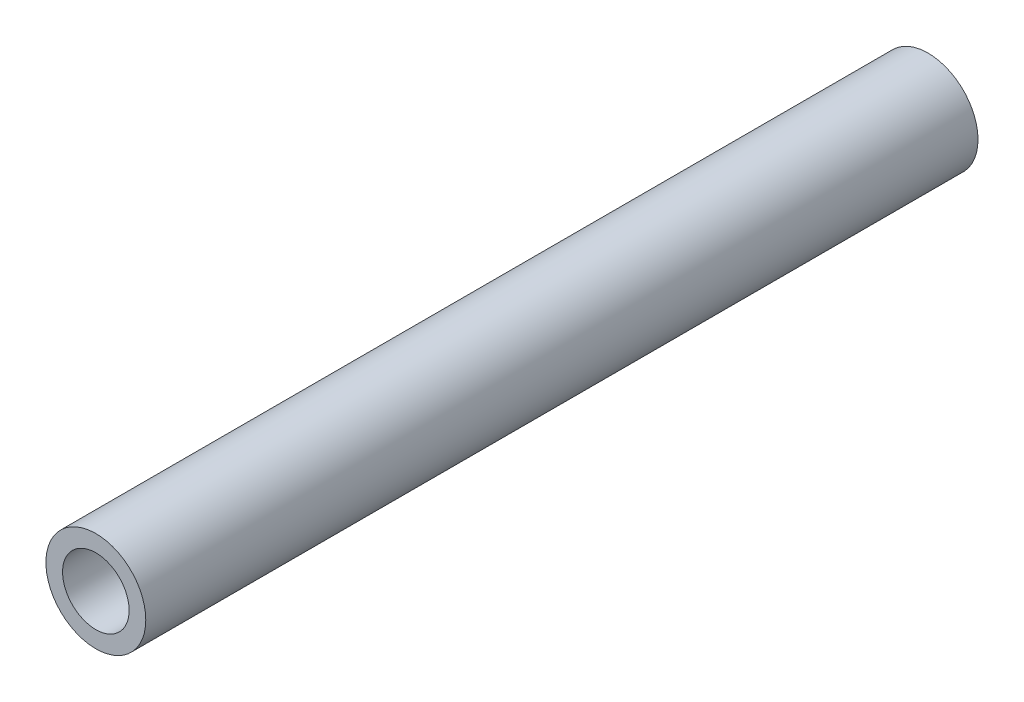
ISO-10303-21;
HEADER;
FILE_DESCRIPTION(('STEP AP214'),'2;1');
FILE_NAME('part.step','',(''),(''),'','','');
FILE_SCHEMA(('AUTOMOTIVE_DESIGN { 1 0 10303 214 1 1 1 1 }'));
ENDSEC;
DATA;
#1=APPLICATION_CONTEXT('core data for automotive mechanical design processes');
#2=APPLICATION_PROTOCOL_DEFINITION('international standard','automotive_design',2000,#1);
#3=PRODUCT_CONTEXT('',#1,'mechanical');
#4=PRODUCT('Part','Part','',(#3));
#5=PRODUCT_RELATED_PRODUCT_CATEGORY('part','',(#4));
#6=PRODUCT_DEFINITION_FORMATION('','',#4);
#7=PRODUCT_DEFINITION_CONTEXT('part definition',#1,'design');
#8=PRODUCT_DEFINITION('design','',#6,#7);
#9=PRODUCT_DEFINITION_SHAPE('','',#8);
#10=(LENGTH_UNIT() NAMED_UNIT(*) SI_UNIT(.MILLI.,.METRE.));
#11=(NAMED_UNIT(*) PLANE_ANGLE_UNIT() SI_UNIT($,.RADIAN.));
#12=(NAMED_UNIT(*) SI_UNIT($,.STERADIAN.) SOLID_ANGLE_UNIT());
#13=UNCERTAINTY_MEASURE_WITH_UNIT(LENGTH_MEASURE(1.E-05),#10,'distance_accuracy_value','');
#14=(GEOMETRIC_REPRESENTATION_CONTEXT(3) GLOBAL_UNCERTAINTY_ASSIGNED_CONTEXT((#13)) GLOBAL_UNIT_ASSIGNED_CONTEXT((#10,
#11,#12)) REPRESENTATION_CONTEXT('',''));
#15=CARTESIAN_POINT('',(0.,0.,0.));
#16=DIRECTION('',(0.,0.,1.));
#17=DIRECTION('',(1.,0.,0.));
#18=AXIS2_PLACEMENT_3D('',#15,#16,#17);
#19=CARTESIAN_POINT('',(0.,0.,127.));
#20=DIRECTION('',(0.,0.,1.));
#21=DIRECTION('',(1.,0.,0.));
#22=AXIS2_PLACEMENT_3D('',#19,#20,#21);
#23=PLANE('',#22);
#24=CARTESIAN_POINT('',(0.,0.,127.));
#25=DIRECTION('',(0.,0.,1.));
#26=DIRECTION('',(1.,0.,0.));
#27=AXIS2_PLACEMENT_3D('',#24,#25,#26);
#28=CIRCLE('',#27,7.62);
#29=CARTESIAN_POINT('',(7.62,0.,127.));
#30=VERTEX_POINT('',#29);
#31=EDGE_CURVE('E10',#30,#30,#28,.T.);
#32=ORIENTED_EDGE('',*,*,#31,.T.);
#33=EDGE_LOOP('',(#32));
#34=FACE_BOUND('',#33,.T.);
#35=CARTESIAN_POINT('',(0.,0.,127.));
#36=DIRECTION('',(0.,0.,1.));
#37=DIRECTION('',(1.,0.,0.));
#38=AXIS2_PLACEMENT_3D('',#35,#36,#37);
#39=CIRCLE('',#38,5.08);
#40=CARTESIAN_POINT('',(5.08,0.,127.));
#41=VERTEX_POINT('',#40);
#42=EDGE_CURVE('E41',#41,#41,#39,.T.);
#43=ORIENTED_EDGE('',*,*,#42,.F.);
#44=EDGE_LOOP('',(#43));
#45=FACE_BOUND('',#44,.T.);
#46=ADVANCED_FACE('F30',(#34,#45),#23,.T.);
#47=CARTESIAN_POINT('',(0.,0.,0.));
#48=DIRECTION('',(0.,0.,1.));
#49=DIRECTION('',(1.,0.,0.));
#50=AXIS2_PLACEMENT_3D('',#47,#48,#49);
#51=PLANE('',#50);
#52=CARTESIAN_POINT('',(0.,0.,0.));
#53=DIRECTION('',(0.,0.,1.));
#54=DIRECTION('',(1.,0.,0.));
#55=AXIS2_PLACEMENT_3D('',#52,#53,#54);
#56=CIRCLE('',#55,7.62);
#57=CARTESIAN_POINT('',(7.62,0.,0.));
#58=VERTEX_POINT('',#57);
#59=EDGE_CURVE('E34',#58,#58,#56,.T.);
#60=ORIENTED_EDGE('',*,*,#59,.F.);
#61=EDGE_LOOP('',(#60));
#62=FACE_BOUND('',#61,.T.);
#63=CARTESIAN_POINT('',(0.,0.,0.));
#64=DIRECTION('',(0.,0.,1.));
#65=DIRECTION('',(1.,0.,0.));
#66=AXIS2_PLACEMENT_3D('',#63,#64,#65);
#67=CIRCLE('',#66,5.08);
#68=CARTESIAN_POINT('',(5.08,0.,0.));
#69=VERTEX_POINT('',#68);
#70=EDGE_CURVE('E43',#69,#69,#67,.T.);
#71=ORIENTED_EDGE('',*,*,#70,.T.);
#72=EDGE_LOOP('',(#71));
#73=FACE_BOUND('',#72,.T.);
#74=ADVANCED_FACE('F53',(#62,#73),#51,.F.);
#75=CARTESIAN_POINT('',(0.,0.,127.));
#76=DIRECTION('',(0.,0.,-1.));
#77=DIRECTION('',(-1.,0.,0.));
#78=AXIS2_PLACEMENT_3D('',#75,#76,#77);
#79=CYLINDRICAL_SURFACE('',#78,7.62);
#80=ORIENTED_EDGE('',*,*,#31,.F.);
#81=EDGE_LOOP('',(#80));
#82=FACE_BOUND('',#81,.T.);
#83=ORIENTED_EDGE('',*,*,#59,.T.);
#84=EDGE_LOOP('',(#83));
#85=FACE_BOUND('',#84,.T.);
#86=ADVANCED_FACE('F32',(#82,#85),#79,.T.);
#87=CARTESIAN_POINT('',(0.,0.,127.));
#88=DIRECTION('',(0.,0.,-1.));
#89=DIRECTION('',(-1.,0.,0.));
#90=AXIS2_PLACEMENT_3D('',#87,#88,#89);
#91=CYLINDRICAL_SURFACE('',#90,5.08);
#92=ORIENTED_EDGE('',*,*,#42,.T.);
#93=EDGE_LOOP('',(#92));
#94=FACE_BOUND('',#93,.T.);
#95=ORIENTED_EDGE('',*,*,#70,.F.);
#96=EDGE_LOOP('',(#95));
#97=FACE_BOUND('',#96,.T.);
#98=ADVANCED_FACE('F49',(#94,#97),#91,.F.);
#99=CLOSED_SHELL('',(#46,#74,#86,#98));
#100=MANIFOLD_SOLID_BREP('B2',#99);
#101=ADVANCED_BREP_SHAPE_REPRESENTATION('',(#18,#100),#14);
#102=SHAPE_DEFINITION_REPRESENTATION(#9,#101);
ENDSEC;
END-ISO-10303-21;
